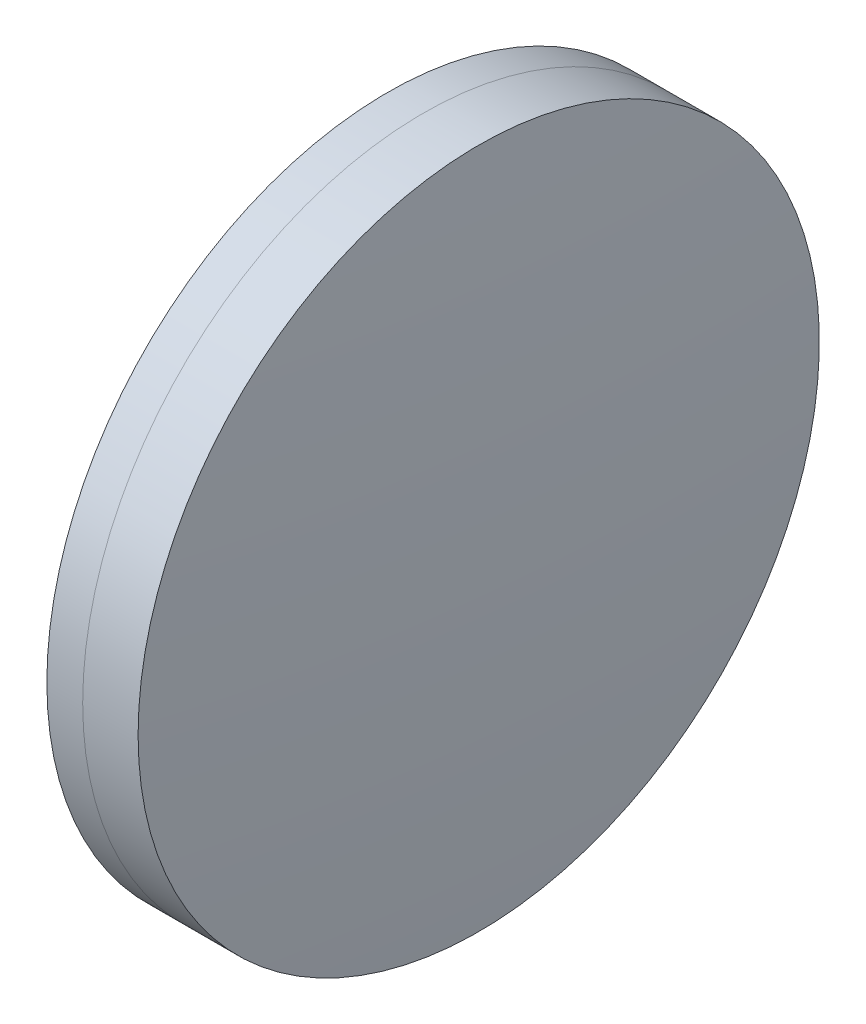
ISO-10303-21;
HEADER;
FILE_DESCRIPTION(('STEP AP214'),'2;1');
FILE_NAME('part.step','',(''),(''),'','','');
FILE_SCHEMA(('AUTOMOTIVE_DESIGN { 1 0 10303 214 1 1 1 1 }'));
ENDSEC;
DATA;
#1=APPLICATION_CONTEXT('core data for automotive mechanical design processes');
#2=APPLICATION_PROTOCOL_DEFINITION('international standard','automotive_design',2000,#1);
#3=PRODUCT_CONTEXT('',#1,'mechanical');
#4=PRODUCT('Part','Part','',(#3));
#5=PRODUCT_RELATED_PRODUCT_CATEGORY('part','',(#4));
#6=PRODUCT_DEFINITION_FORMATION('','',#4);
#7=PRODUCT_DEFINITION_CONTEXT('part definition',#1,'design');
#8=PRODUCT_DEFINITION('design','',#6,#7);
#9=PRODUCT_DEFINITION_SHAPE('','',#8);
#10=(LENGTH_UNIT() NAMED_UNIT(*) SI_UNIT(.MILLI.,.METRE.));
#11=(NAMED_UNIT(*) PLANE_ANGLE_UNIT() SI_UNIT($,.RADIAN.));
#12=(NAMED_UNIT(*) SI_UNIT($,.STERADIAN.) SOLID_ANGLE_UNIT());
#13=UNCERTAINTY_MEASURE_WITH_UNIT(LENGTH_MEASURE(1.E-05),#10,'distance_accuracy_value','');
#14=(GEOMETRIC_REPRESENTATION_CONTEXT(3) GLOBAL_UNCERTAINTY_ASSIGNED_CONTEXT((#13)) GLOBAL_UNIT_ASSIGNED_CONTEXT((#10,
#11,#12)) REPRESENTATION_CONTEXT('',''));
#15=CARTESIAN_POINT('',(0.,0.,0.));
#16=DIRECTION('',(0.,0.,1.));
#17=DIRECTION('',(1.,0.,0.));
#18=AXIS2_PLACEMENT_3D('',#15,#16,#17);
#19=CARTESIAN_POINT('',(131.856708918552,0.,0.));
#20=DIRECTION('',(-1.,0.,0.));
#21=DIRECTION('',(0.,0.,1.));
#22=AXIS2_PLACEMENT_3D('',#19,#20,#21);
#23=SPHERICAL_SURFACE('',#22,118.325);
#24=CARTESIAN_POINT('',(247.510526948913,0.,0.));
#25=DIRECTION('',(-1.,0.,0.));
#26=DIRECTION('',(0.,0.,1.));
#27=AXIS2_PLACEMENT_3D('',#24,#25,#26);
#28=CIRCLE('',#27,25.);
#29=CARTESIAN_POINT('',(247.510526948913,0.,25.));
#30=VERTEX_POINT('',#29);
#31=EDGE_CURVE('E11',#30,#30,#28,.T.);
#32=ORIENTED_EDGE('',*,*,#31,.T.);
#33=EDGE_LOOP('',(#32));
#34=FACE_BOUND('',#33,.T.);
#35=ADVANCED_FACE('F43',(#34),#23,.F.);
#36=CARTESIAN_POINT('',(-0.551919992657797,0.,0.));
#37=DIRECTION('',(-1.,0.,0.));
#38=DIRECTION('',(0.,0.,1.));
#39=AXIS2_PLACEMENT_3D('',#36,#37,#38);
#40=CYLINDRICAL_SURFACE('',#39,25.);
#41=CARTESIAN_POINT('',(251.577458698838,0.,0.));
#42=DIRECTION('',(-1.,0.,0.));
#43=DIRECTION('',(0.,0.,1.));
#44=AXIS2_PLACEMENT_3D('',#41,#42,#43);
#45=CIRCLE('',#44,24.9999999999999);
#46=CARTESIAN_POINT('',(251.577458698838,0.,24.9999999999999));
#47=VERTEX_POINT('',#46);
#48=EDGE_CURVE('E49',#47,#47,#45,.T.);
#49=ORIENTED_EDGE('',*,*,#48,.T.);
#50=EDGE_LOOP('',(#49));
#51=FACE_BOUND('',#50,.T.);
#52=ORIENTED_EDGE('',*,*,#31,.F.);
#53=EDGE_LOOP('',(#52));
#54=FACE_BOUND('',#53,.T.);
#55=ADVANCED_FACE('F55',(#51,#54),#40,.T.);
#56=CARTESIAN_POINT('',(-113.813291081448,0.,0.));
#57=DIRECTION('',(-1.,0.,0.));
#58=DIRECTION('',(0.,0.,1.));
#59=AXIS2_PLACEMENT_3D('',#56,#57,#58);
#60=SPHERICAL_SURFACE('',#59,366.245);
#61=ORIENTED_EDGE('',*,*,#48,.F.);
#62=EDGE_LOOP('',(#61));
#63=FACE_BOUND('',#62,.T.);
#64=ADVANCED_FACE('F58',(#63),#60,.T.);
#65=CLOSED_SHELL('',(#35,#55,#64));
#66=MANIFOLD_SOLID_BREP('B2',#65);
#67=CARTESIAN_POINT('',(399.405708918552,0.,-1.23095121869381E-13));
#68=DIRECTION('',(-1.,0.,0.));
#69=DIRECTION('',(0.,0.,1.));
#70=AXIS2_PLACEMENT_3D('',#67,#68,#69);
#71=SPHERICAL_SURFACE('',#70,156.534);
#72=CARTESIAN_POINT('',(244.88097576557,0.,0.));
#73=DIRECTION('',(-1.,0.,0.));
#74=DIRECTION('',(0.,0.,1.));
#75=AXIS2_PLACEMENT_3D('',#72,#73,#74);
#76=CIRCLE('',#75,25.);
#77=CARTESIAN_POINT('',(244.88097576557,0.,25.));
#78=VERTEX_POINT('',#77);
#79=EDGE_CURVE('E42',#78,#78,#76,.T.);
#80=ORIENTED_EDGE('',*,*,#79,.T.);
#81=EDGE_LOOP('',(#80));
#82=FACE_BOUND('',#81,.T.);
#83=ADVANCED_FACE('F84',(#82),#71,.T.);
#84=CARTESIAN_POINT('',(124.523309526045,0.,0.));
#85=DIRECTION('',(-1.,0.,0.));
#86=DIRECTION('',(0.,0.,1.));
#87=AXIS2_PLACEMENT_3D('',#84,#85,#86);
#88=CYLINDRICAL_SURFACE('',#87,25.);
#89=CARTESIAN_POINT('',(247.510526948913,0.,0.));
#90=DIRECTION('',(-1.,0.,0.));
#91=DIRECTION('',(0.,0.,1.));
#92=AXIS2_PLACEMENT_3D('',#89,#90,#91);
#93=CIRCLE('',#92,25.);
#94=CARTESIAN_POINT('',(247.510526948913,0.,25.));
#95=VERTEX_POINT('',#94);
#96=EDGE_CURVE('E90',#95,#95,#93,.T.);
#97=ORIENTED_EDGE('',*,*,#96,.T.);
#98=EDGE_LOOP('',(#97));
#99=FACE_BOUND('',#98,.T.);
#100=ORIENTED_EDGE('',*,*,#79,.F.);
#101=EDGE_LOOP('',(#100));
#102=FACE_BOUND('',#101,.T.);
#103=ADVANCED_FACE('F96',(#99,#102),#88,.T.);
#104=CARTESIAN_POINT('',(131.856708918552,0.,0.));
#105=DIRECTION('',(-1.,0.,0.));
#106=DIRECTION('',(0.,0.,1.));
#107=AXIS2_PLACEMENT_3D('',#104,#105,#106);
#108=SPHERICAL_SURFACE('',#107,118.325);
#109=ORIENTED_EDGE('',*,*,#96,.F.);
#110=EDGE_LOOP('',(#109));
#111=FACE_BOUND('',#110,.T.);
#112=ADVANCED_FACE('F99',(#111),#108,.T.);
#113=CLOSED_SHELL('',(#83,#103,#112));
#114=MANIFOLD_SOLID_BREP('B6',#113);
#115=ADVANCED_BREP_SHAPE_REPRESENTATION('',(#18,#66,#114),#14);
#116=SHAPE_DEFINITION_REPRESENTATION(#9,#115);
ENDSEC;
END-ISO-10303-21;
